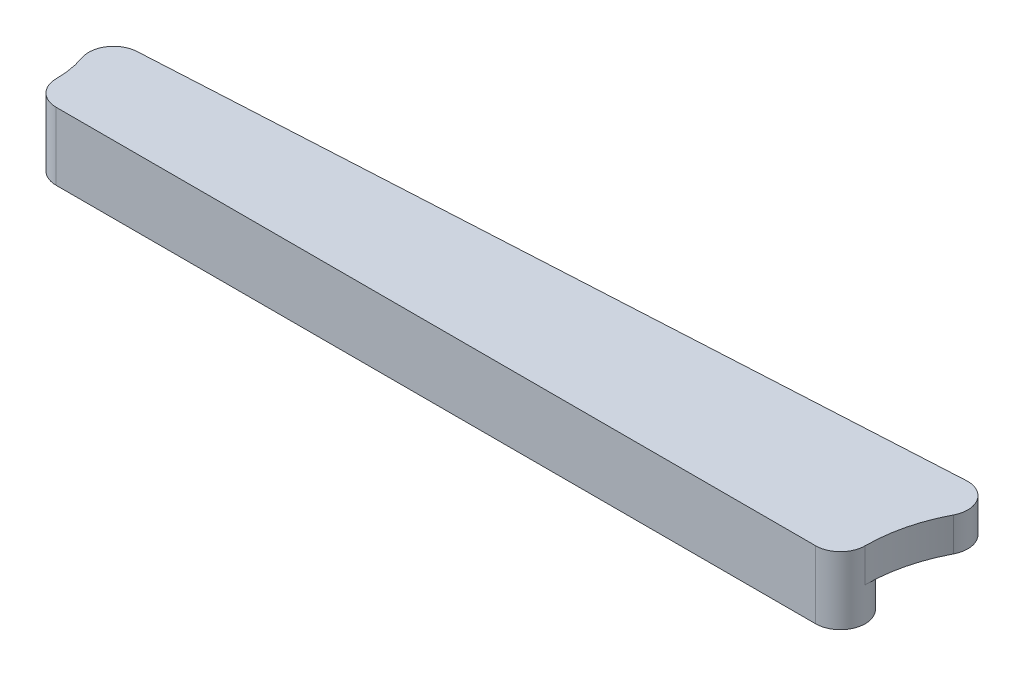
ISO-10303-21;
HEADER;
FILE_DESCRIPTION(('STEP AP214'),'2;1');
FILE_NAME('part.step','',(''),(''),'','','');
FILE_SCHEMA(('AUTOMOTIVE_DESIGN { 1 0 10303 214 1 1 1 1 }'));
ENDSEC;
DATA;
#1=APPLICATION_CONTEXT('core data for automotive mechanical design processes');
#2=APPLICATION_PROTOCOL_DEFINITION('international standard','automotive_design',2000,#1);
#3=PRODUCT_CONTEXT('',#1,'mechanical');
#4=PRODUCT('Part','Part','',(#3));
#5=PRODUCT_RELATED_PRODUCT_CATEGORY('part','',(#4));
#6=PRODUCT_DEFINITION_FORMATION('','',#4);
#7=PRODUCT_DEFINITION_CONTEXT('part definition',#1,'design');
#8=PRODUCT_DEFINITION('design','',#6,#7);
#9=PRODUCT_DEFINITION_SHAPE('','',#8);
#10=(LENGTH_UNIT() NAMED_UNIT(*) SI_UNIT(.MILLI.,.METRE.));
#11=(NAMED_UNIT(*) PLANE_ANGLE_UNIT() SI_UNIT($,.RADIAN.));
#12=(NAMED_UNIT(*) SI_UNIT($,.STERADIAN.) SOLID_ANGLE_UNIT());
#13=UNCERTAINTY_MEASURE_WITH_UNIT(LENGTH_MEASURE(1.E-05),#10,'distance_accuracy_value','');
#14=(GEOMETRIC_REPRESENTATION_CONTEXT(3) GLOBAL_UNCERTAINTY_ASSIGNED_CONTEXT((#13)) GLOBAL_UNIT_ASSIGNED_CONTEXT((#10,
#11,#12)) REPRESENTATION_CONTEXT('',''));
#15=CARTESIAN_POINT('',(0.,0.,0.));
#16=DIRECTION('',(0.,0.,1.));
#17=DIRECTION('',(1.,0.,0.));
#18=AXIS2_PLACEMENT_3D('',#15,#16,#17);
#19=CARTESIAN_POINT('',(73.025,6.499999954,0.));
#20=DIRECTION('',(0.,-1.,0.));
#21=DIRECTION('',(0.,0.,-1.));
#22=AXIS2_PLACEMENT_3D('',#19,#20,#21);
#23=CYLINDRICAL_SURFACE('',#22,4.7625);
#24=DIRECTION('',(0.,-1.,0.));
#25=VECTOR('',#24,1.);
#26=CARTESIAN_POINT('',(77.7875,168.556908160657,0.));
#27=LINE('',#26,#25);
#28=CARTESIAN_POINT('',(77.7875,6.499999954,0.));
#29=VERTEX_POINT('',#28);
#30=CARTESIAN_POINT('',(77.7875,0.,0.));
#31=VERTEX_POINT('',#30);
#32=EDGE_CURVE('E125',#29,#31,#27,.T.);
#33=ORIENTED_EDGE('',*,*,#32,.F.);
#34=CARTESIAN_POINT('',(73.025,6.499999954,0.));
#35=DIRECTION('',(0.,1.,0.));
#36=DIRECTION('',(0.,0.,1.));
#37=AXIS2_PLACEMENT_3D('',#34,#35,#36);
#38=CIRCLE('',#37,4.7625);
#39=CARTESIAN_POINT('',(73.025,6.499999954,4.76249999999997));
#40=VERTEX_POINT('',#39);
#41=EDGE_CURVE('E83',#40,#29,#38,.T.);
#42=ORIENTED_EDGE('',*,*,#41,.F.);
#43=DIRECTION('',(0.,-1.,0.));
#44=VECTOR('',#43,1.);
#45=CARTESIAN_POINT('',(73.025,6.499999954,4.76249999999997));
#46=LINE('',#45,#44);
#47=CARTESIAN_POINT('',(73.025,-6.499999954,4.76249999999997));
#48=VERTEX_POINT('',#47);
#49=EDGE_CURVE('E42',#40,#48,#46,.T.);
#50=ORIENTED_EDGE('',*,*,#49,.T.);
#51=CARTESIAN_POINT('',(73.025,-6.499999954,0.));
#52=DIRECTION('',(0.,1.,0.));
#53=DIRECTION('',(0.,0.,1.));
#54=AXIS2_PLACEMENT_3D('',#51,#52,#53);
#55=CIRCLE('',#54,4.7625);
#56=CARTESIAN_POINT('',(73.025,-6.499999954,-4.76250000000003));
#57=VERTEX_POINT('',#56);
#58=EDGE_CURVE('E91',#48,#57,#55,.T.);
#59=ORIENTED_EDGE('',*,*,#58,.T.);
#60=DIRECTION('',(0.,-1.,0.));
#61=VECTOR('',#60,1.);
#62=CARTESIAN_POINT('',(73.025,6.499999954,-4.76250000000003));
#63=LINE('',#62,#61);
#64=CARTESIAN_POINT('',(73.025,0.,-4.76250000000003));
#65=VERTEX_POINT('',#64);
#66=EDGE_CURVE('E67',#65,#57,#63,.T.);
#67=ORIENTED_EDGE('',*,*,#66,.F.);
#68=CARTESIAN_POINT('',(73.025,0.,0.));
#69=DIRECTION('',(0.,-1.,0.));
#70=DIRECTION('',(0.,0.,1.));
#71=AXIS2_PLACEMENT_3D('',#68,#69,#70);
#72=CIRCLE('',#71,4.7625);
#73=EDGE_CURVE('E160',#65,#31,#72,.T.);
#74=ORIENTED_EDGE('',*,*,#73,.T.);
#75=EDGE_LOOP('',(#33,#42,#50,#59,#67,#74));
#76=FACE_BOUND('',#75,.T.);
#77=ADVANCED_FACE('F33',(#76),#23,.T.);
#78=CARTESIAN_POINT('',(-73.025,6.499999954,-4.7625));
#79=DIRECTION('',(0.,0.,1.));
#80=DIRECTION('',(1.,0.,0.));
#81=AXIS2_PLACEMENT_3D('',#78,#79,#80);
#82=PLANE('',#81);
#83=DIRECTION('',(1.,0.,0.));
#84=VECTOR('',#83,1.);
#85=CARTESIAN_POINT('',(73.025,0.,-4.76250000000003));
#86=LINE('',#85,#84);
#87=CARTESIAN_POINT('',(-73.025,0.,-4.76250000000001));
#88=VERTEX_POINT('',#87);
#89=EDGE_CURVE('E142',#88,#65,#86,.T.);
#90=ORIENTED_EDGE('',*,*,#89,.T.);
#91=ORIENTED_EDGE('',*,*,#66,.T.);
#92=DIRECTION('',(-1.,0.,0.));
#93=VECTOR('',#92,1.);
#94=CARTESIAN_POINT('',(-73.025,-6.499999954,-4.7625));
#95=LINE('',#94,#93);
#96=CARTESIAN_POINT('',(-73.025,-6.499999954,-4.7625));
#97=VERTEX_POINT('',#96);
#98=EDGE_CURVE('E86',#57,#97,#95,.T.);
#99=ORIENTED_EDGE('',*,*,#98,.T.);
#100=DIRECTION('',(0.,-1.,0.));
#101=VECTOR('',#100,1.);
#102=CARTESIAN_POINT('',(-73.025,6.499999954,-4.7625));
#103=LINE('',#102,#101);
#104=EDGE_CURVE('E74',#88,#97,#103,.T.);
#105=ORIENTED_EDGE('',*,*,#104,.F.);
#106=EDGE_LOOP('',(#90,#91,#99,#105));
#107=FACE_BOUND('',#106,.T.);
#108=ADVANCED_FACE('F87',(#107),#82,.F.);
#109=CARTESIAN_POINT('',(-73.025,6.499999954,0.));
#110=DIRECTION('',(0.,-1.,0.));
#111=DIRECTION('',(0.,0.,-1.));
#112=AXIS2_PLACEMENT_3D('',#109,#110,#111);
#113=CYLINDRICAL_SURFACE('',#112,4.7625);
#114=CARTESIAN_POINT('',(-73.025,6.499999954,0.));
#115=DIRECTION('',(0.,1.,0.));
#116=DIRECTION('',(0.,0.,1.));
#117=AXIS2_PLACEMENT_3D('',#114,#115,#116);
#118=CIRCLE('',#117,4.7625);
#119=CARTESIAN_POINT('',(-77.7875,6.499999954,0.));
#120=VERTEX_POINT('',#119);
#121=CARTESIAN_POINT('',(-73.025,6.499999954,4.7625));
#122=VERTEX_POINT('',#121);
#123=EDGE_CURVE('E90',#120,#122,#118,.T.);
#124=ORIENTED_EDGE('',*,*,#123,.F.);
#125=DIRECTION('',(0.,-1.,0.));
#126=VECTOR('',#125,1.);
#127=CARTESIAN_POINT('',(-77.7875,168.556908160657,0.));
#128=LINE('',#127,#126);
#129=CARTESIAN_POINT('',(-77.7875,0.,0.));
#130=VERTEX_POINT('',#129);
#131=EDGE_CURVE('E114',#120,#130,#128,.T.);
#132=ORIENTED_EDGE('',*,*,#131,.T.);
#133=CARTESIAN_POINT('',(-73.025,0.,0.));
#134=DIRECTION('',(0.,-1.,0.));
#135=DIRECTION('',(0.,0.,-1.));
#136=AXIS2_PLACEMENT_3D('',#133,#134,#135);
#137=CIRCLE('',#136,4.7625);
#138=EDGE_CURVE('E82',#130,#88,#137,.T.);
#139=ORIENTED_EDGE('',*,*,#138,.T.);
#140=ORIENTED_EDGE('',*,*,#104,.T.);
#141=CARTESIAN_POINT('',(-73.025,-6.499999954,0.));
#142=DIRECTION('',(0.,1.,0.));
#143=DIRECTION('',(0.,0.,1.));
#144=AXIS2_PLACEMENT_3D('',#141,#142,#143);
#145=CIRCLE('',#144,4.7625);
#146=CARTESIAN_POINT('',(-73.025,-6.499999954,4.7625));
#147=VERTEX_POINT('',#146);
#148=EDGE_CURVE('E78',#97,#147,#145,.T.);
#149=ORIENTED_EDGE('',*,*,#148,.T.);
#150=DIRECTION('',(0.,-1.,0.));
#151=VECTOR('',#150,1.);
#152=CARTESIAN_POINT('',(-73.025,6.499999954,4.7625));
#153=LINE('',#152,#151);
#154=EDGE_CURVE('E11',#122,#147,#153,.T.);
#155=ORIENTED_EDGE('',*,*,#154,.F.);
#156=EDGE_LOOP('',(#124,#132,#139,#140,#149,#155));
#157=FACE_BOUND('',#156,.T.);
#158=ADVANCED_FACE('F35',(#157),#113,.T.);
#159=CARTESIAN_POINT('',(-73.025,6.499999954,4.7625));
#160=DIRECTION('',(0.,0.,-1.));
#161=DIRECTION('',(-1.,0.,0.));
#162=AXIS2_PLACEMENT_3D('',#159,#160,#161);
#163=PLANE('',#162);
#164=DIRECTION('',(1.,0.,0.));
#165=VECTOR('',#164,1.);
#166=CARTESIAN_POINT('',(-73.025,-6.499999954,4.7625));
#167=LINE('',#166,#165);
#168=EDGE_CURVE('E94',#147,#48,#167,.T.);
#169=ORIENTED_EDGE('',*,*,#168,.T.);
#170=ORIENTED_EDGE('',*,*,#49,.F.);
#171=DIRECTION('',(1.,0.,0.));
#172=VECTOR('',#171,1.);
#173=CARTESIAN_POINT('',(-73.025,6.499999954,4.7625));
#174=LINE('',#173,#172);
#175=EDGE_CURVE('E50',#122,#40,#174,.T.);
#176=ORIENTED_EDGE('',*,*,#175,.F.);
#177=ORIENTED_EDGE('',*,*,#154,.T.);
#178=EDGE_LOOP('',(#169,#170,#176,#177));
#179=FACE_BOUND('',#178,.T.);
#180=ADVANCED_FACE('F110',(#179),#163,.F.);
#181=CARTESIAN_POINT('',(-73.025,6.499999954,0.));
#182=DIRECTION('',(0.,1.,0.));
#183=DIRECTION('',(0.,0.,1.));
#184=AXIS2_PLACEMENT_3D('',#181,#182,#183);
#185=PLANE('',#184);
#186=ORIENTED_EDGE('',*,*,#41,.T.);
#187=CARTESIAN_POINT('',(107.15625,6.499999954,0.));
#188=DIRECTION('',(0.,1.,0.));
#189=DIRECTION('',(0.,0.,1.));
#190=AXIS2_PLACEMENT_3D('',#187,#188,#189);
#191=CIRCLE('',#190,29.3687499999999);
#192=CARTESIAN_POINT('',(81.1384453103218,6.499999954,-13.6234105748985));
#193=VERTEX_POINT('',#192);
#194=EDGE_CURVE('E95',#29,#193,#191,.F.);
#195=ORIENTED_EDGE('',*,*,#194,.T.);
#196=CARTESIAN_POINT('',(76.9193418471307,6.499999954,-15.832612289747));
#197=DIRECTION('',(0.,1.,0.));
#198=DIRECTION('',(0.,0.,1.));
#199=AXIS2_PLACEMENT_3D('',#196,#197,#198);
#200=CIRCLE('',#199,4.7625);
#201=CARTESIAN_POINT('',(76.6588926283807,6.499999954,-20.5879852987183));
#202=VERTEX_POINT('',#201);
#203=EDGE_CURVE('E99',#193,#202,#200,.T.);
#204=ORIENTED_EDGE('',*,*,#203,.T.);
#205=DIRECTION('',(-0.9985035189441,0.,0.0546875000000001));
#206=VECTOR('',#205,1.);
#207=CARTESIAN_POINT('',(76.6588926283807,6.499999954,-20.5879852987183));
#208=LINE('',#207,#206);
#209=CARTESIAN_POINT('',(-74.5590165380068,6.499999954,-12.3058618503383));
#210=VERTEX_POINT('',#209);
#211=EDGE_CURVE('E121',#202,#210,#208,.T.);
#212=ORIENTED_EDGE('',*,*,#211,.T.);
#213=CARTESIAN_POINT('',(-74.2985673192568,6.499999954,-7.55048884136702));
#214=DIRECTION('',(0.,1.,0.));
#215=DIRECTION('',(0.,0.,1.));
#216=AXIS2_PLACEMENT_3D('',#213,#214,#215);
#217=CIRCLE('',#216,4.7625);
#218=CARTESIAN_POINT('',(-78.7975706325141,6.499999954,-5.9883187362566));
#219=VERTEX_POINT('',#218);
#220=EDGE_CURVE('E124',#210,#219,#217,.T.);
#221=ORIENTED_EDGE('',*,*,#220,.T.);
#222=CARTESIAN_POINT('',(-96.0437500000001,6.499999954,0.));
#223=DIRECTION('',(0.,1.,0.));
#224=DIRECTION('',(0.,0.,1.));
#225=AXIS2_PLACEMENT_3D('',#222,#223,#224);
#226=CIRCLE('',#225,18.2562500000001);
#227=EDGE_CURVE('E128',#219,#120,#226,.F.);
#228=ORIENTED_EDGE('',*,*,#227,.T.);
#229=ORIENTED_EDGE('',*,*,#123,.T.);
#230=ORIENTED_EDGE('',*,*,#175,.T.);
#231=EDGE_LOOP('',(#186,#195,#204,#212,#221,#228,#229,#230));
#232=FACE_BOUND('',#231,.T.);
#233=ADVANCED_FACE('F168',(#232),#185,.T.);
#234=CARTESIAN_POINT('',(-73.025,-6.499999954,0.));
#235=DIRECTION('',(0.,1.,0.));
#236=DIRECTION('',(0.,0.,1.));
#237=AXIS2_PLACEMENT_3D('',#234,#235,#236);
#238=PLANE('',#237);
#239=ORIENTED_EDGE('',*,*,#148,.F.);
#240=ORIENTED_EDGE('',*,*,#98,.F.);
#241=ORIENTED_EDGE('',*,*,#58,.F.);
#242=ORIENTED_EDGE('',*,*,#168,.F.);
#243=EDGE_LOOP('',(#239,#240,#241,#242));
#244=FACE_BOUND('',#243,.T.);
#245=ADVANCED_FACE('F93',(#244),#238,.F.);
#246=CARTESIAN_POINT('',(107.15625,168.556908160657,0.));
#247=DIRECTION('',(0.,-1.,0.));
#248=DIRECTION('',(0.,0.,-1.));
#249=AXIS2_PLACEMENT_3D('',#246,#247,#248);
#250=CYLINDRICAL_SURFACE('',#249,29.3687499999999);
#251=ORIENTED_EDGE('',*,*,#194,.F.);
#252=ORIENTED_EDGE('',*,*,#32,.T.);
#253=CARTESIAN_POINT('',(107.15625,0.,0.));
#254=DIRECTION('',(0.,-1.,0.));
#255=DIRECTION('',(0.,0.,-1.));
#256=AXIS2_PLACEMENT_3D('',#253,#254,#255);
#257=CIRCLE('',#256,29.3687499999999);
#258=CARTESIAN_POINT('',(81.1384453103218,0.,-13.6234105748985));
#259=VERTEX_POINT('',#258);
#260=EDGE_CURVE('E157',#31,#259,#257,.T.);
#261=ORIENTED_EDGE('',*,*,#260,.T.);
#262=DIRECTION('',(0.,-1.,0.));
#263=VECTOR('',#262,1.);
#264=CARTESIAN_POINT('',(81.1384453103218,168.556908160657,-13.6234105748985));
#265=LINE('',#264,#263);
#266=EDGE_CURVE('E129',#193,#259,#265,.T.);
#267=ORIENTED_EDGE('',*,*,#266,.F.);
#268=EDGE_LOOP('',(#251,#252,#261,#267));
#269=FACE_BOUND('',#268,.T.);
#270=ADVANCED_FACE('F215',(#269),#250,.F.);
#271=CARTESIAN_POINT('',(76.9193418471307,168.556908160657,-15.832612289747));
#272=DIRECTION('',(0.,-1.,0.));
#273=DIRECTION('',(0.,0.,-1.));
#274=AXIS2_PLACEMENT_3D('',#271,#272,#273);
#275=CYLINDRICAL_SURFACE('',#274,4.7625);
#276=ORIENTED_EDGE('',*,*,#203,.F.);
#277=ORIENTED_EDGE('',*,*,#266,.T.);
#278=CARTESIAN_POINT('',(76.9193418471307,0.,-15.832612289747));
#279=DIRECTION('',(0.,1.,0.));
#280=DIRECTION('',(0.,0.,1.));
#281=AXIS2_PLACEMENT_3D('',#278,#279,#280);
#282=CIRCLE('',#281,4.7625);
#283=CARTESIAN_POINT('',(76.6588926283807,0.,-20.5879852987183));
#284=VERTEX_POINT('',#283);
#285=EDGE_CURVE('E154',#259,#284,#282,.T.);
#286=ORIENTED_EDGE('',*,*,#285,.T.);
#287=DIRECTION('',(0.,-1.,0.));
#288=VECTOR('',#287,1.);
#289=CARTESIAN_POINT('',(76.6588926283807,168.556908160657,-20.5879852987183));
#290=LINE('',#289,#288);
#291=EDGE_CURVE('E132',#202,#284,#290,.T.);
#292=ORIENTED_EDGE('',*,*,#291,.F.);
#293=EDGE_LOOP('',(#276,#277,#286,#292));
#294=FACE_BOUND('',#293,.T.);
#295=ADVANCED_FACE('F213',(#294),#275,.T.);
#296=CARTESIAN_POINT('',(76.6588926283807,168.556908160657,-20.5879852987183));
#297=DIRECTION('',(0.0546875000000001,0.,0.9985035189441));
#298=DIRECTION('',(0.9985035189441,0.,-0.0546875000000001));
#299=AXIS2_PLACEMENT_3D('',#296,#297,#298);
#300=PLANE('',#299);
#301=ORIENTED_EDGE('',*,*,#211,.F.);
#302=ORIENTED_EDGE('',*,*,#291,.T.);
#303=DIRECTION('',(-0.9985035189441,0.,0.0546875000000001));
#304=VECTOR('',#303,1.);
#305=CARTESIAN_POINT('',(76.6588926283807,0.,-20.5879852987183));
#306=LINE('',#305,#304);
#307=CARTESIAN_POINT('',(-74.5590165380068,0.,-12.3058618503383));
#308=VERTEX_POINT('',#307);
#309=EDGE_CURVE('E151',#284,#308,#306,.T.);
#310=ORIENTED_EDGE('',*,*,#309,.T.);
#311=DIRECTION('',(0.,-1.,0.));
#312=VECTOR('',#311,1.);
#313=CARTESIAN_POINT('',(-74.5590165380068,168.556908160657,-12.3058618503383));
#314=LINE('',#313,#312);
#315=EDGE_CURVE('E135',#210,#308,#314,.T.);
#316=ORIENTED_EDGE('',*,*,#315,.F.);
#317=EDGE_LOOP('',(#301,#302,#310,#316));
#318=FACE_BOUND('',#317,.T.);
#319=ADVANCED_FACE('F209',(#318),#300,.F.);
#320=CARTESIAN_POINT('',(-74.2985673192568,168.556908160657,-7.55048884136702));
#321=DIRECTION('',(0.,-1.,0.));
#322=DIRECTION('',(0.,0.,-1.));
#323=AXIS2_PLACEMENT_3D('',#320,#321,#322);
#324=CYLINDRICAL_SURFACE('',#323,4.7625);
#325=ORIENTED_EDGE('',*,*,#220,.F.);
#326=ORIENTED_EDGE('',*,*,#315,.T.);
#327=CARTESIAN_POINT('',(-74.2985673192568,0.,-7.55048884136702));
#328=DIRECTION('',(0.,1.,0.));
#329=DIRECTION('',(0.,0.,-1.));
#330=AXIS2_PLACEMENT_3D('',#327,#328,#329);
#331=CIRCLE('',#330,4.7625);
#332=CARTESIAN_POINT('',(-78.7975706325141,0.,-5.9883187362566));
#333=VERTEX_POINT('',#332);
#334=EDGE_CURVE('E148',#308,#333,#331,.T.);
#335=ORIENTED_EDGE('',*,*,#334,.T.);
#336=DIRECTION('',(0.,-1.,0.));
#337=VECTOR('',#336,1.);
#338=CARTESIAN_POINT('',(-78.7975706325141,168.556908160657,-5.9883187362566));
#339=LINE('',#338,#337);
#340=EDGE_CURVE('E138',#219,#333,#339,.T.);
#341=ORIENTED_EDGE('',*,*,#340,.F.);
#342=EDGE_LOOP('',(#325,#326,#335,#341));
#343=FACE_BOUND('',#342,.T.);
#344=ADVANCED_FACE('F208',(#343),#324,.T.);
#345=CARTESIAN_POINT('',(-96.0437500000001,168.556908160657,0.));
#346=DIRECTION('',(0.,-1.,0.));
#347=DIRECTION('',(0.,0.,-1.));
#348=AXIS2_PLACEMENT_3D('',#345,#346,#347);
#349=CYLINDRICAL_SURFACE('',#348,18.2562500000001);
#350=ORIENTED_EDGE('',*,*,#227,.F.);
#351=ORIENTED_EDGE('',*,*,#340,.T.);
#352=CARTESIAN_POINT('',(-96.0437500000001,0.,0.));
#353=DIRECTION('',(0.,-1.,0.));
#354=DIRECTION('',(0.,0.,1.));
#355=AXIS2_PLACEMENT_3D('',#352,#353,#354);
#356=CIRCLE('',#355,18.2562500000001);
#357=EDGE_CURVE('E145',#333,#130,#356,.T.);
#358=ORIENTED_EDGE('',*,*,#357,.T.);
#359=ORIENTED_EDGE('',*,*,#131,.F.);
#360=EDGE_LOOP('',(#350,#351,#358,#359));
#361=FACE_BOUND('',#360,.T.);
#362=ADVANCED_FACE('F172',(#361),#349,.F.);
#363=CARTESIAN_POINT('',(73.025,0.,0.));
#364=DIRECTION('',(0.,1.,0.));
#365=DIRECTION('',(0.,0.,1.));
#366=AXIS2_PLACEMENT_3D('',#363,#364,#365);
#367=PLANE('',#366);
#368=ORIENTED_EDGE('',*,*,#73,.F.);
#369=ORIENTED_EDGE('',*,*,#89,.F.);
#370=ORIENTED_EDGE('',*,*,#138,.F.);
#371=ORIENTED_EDGE('',*,*,#357,.F.);
#372=ORIENTED_EDGE('',*,*,#334,.F.);
#373=ORIENTED_EDGE('',*,*,#309,.F.);
#374=ORIENTED_EDGE('',*,*,#285,.F.);
#375=ORIENTED_EDGE('',*,*,#260,.F.);
#376=EDGE_LOOP('',(#368,#369,#370,#371,#372,#373,#374,#375));
#377=FACE_BOUND('',#376,.T.);
#378=ADVANCED_FACE('F180',(#377),#367,.F.);
#379=CLOSED_SHELL('',(#77,#108,#158,#180,#233,#245,#270,#295,#319,#344,#362,#378));
#380=MANIFOLD_SOLID_BREP('B2',#379);
#381=ADVANCED_BREP_SHAPE_REPRESENTATION('',(#18,#380),#14);
#382=SHAPE_DEFINITION_REPRESENTATION(#9,#381);
ENDSEC;
END-ISO-10303-21;
